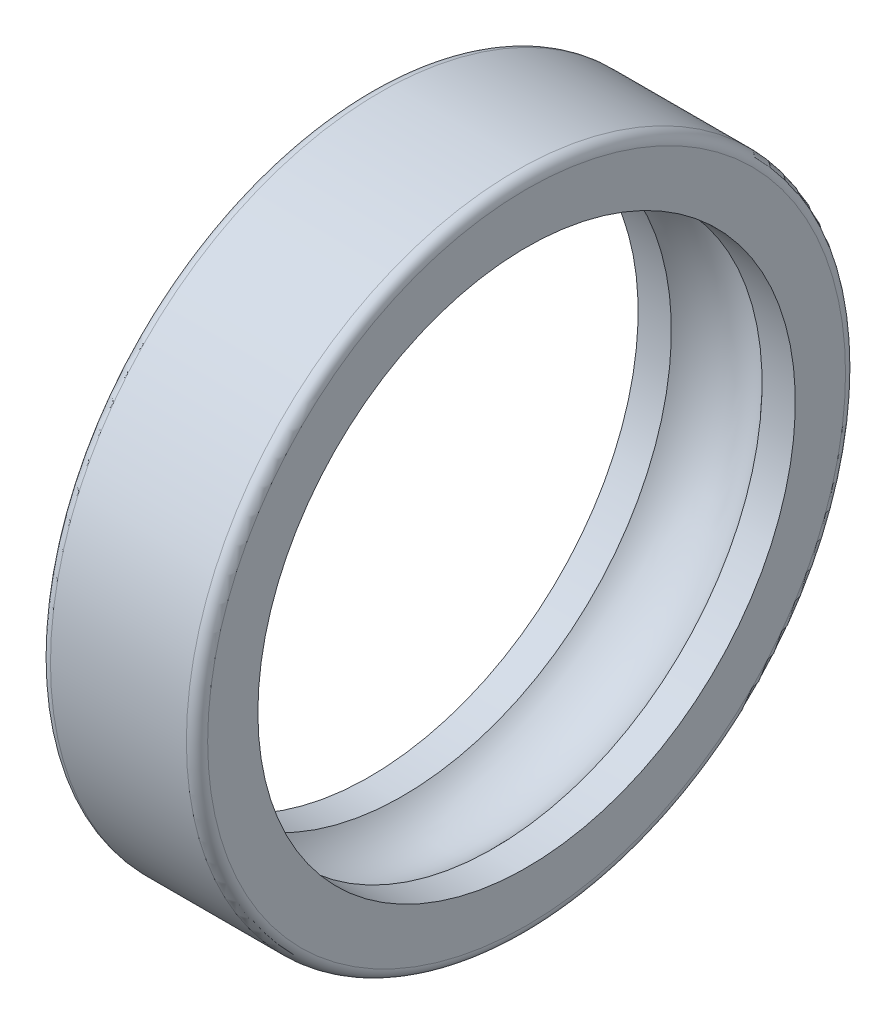
ISO-10303-21;
HEADER;
FILE_DESCRIPTION(('STEP AP214'),'2;1');
FILE_NAME('part.step','',(''),(''),'','','');
FILE_SCHEMA(('AUTOMOTIVE_DESIGN { 1 0 10303 214 1 1 1 1 }'));
ENDSEC;
DATA;
#1=APPLICATION_CONTEXT('core data for automotive mechanical design processes');
#2=APPLICATION_PROTOCOL_DEFINITION('international standard','automotive_design',2000,#1);
#3=PRODUCT_CONTEXT('',#1,'mechanical');
#4=PRODUCT('Part','Part','',(#3));
#5=PRODUCT_RELATED_PRODUCT_CATEGORY('part','',(#4));
#6=PRODUCT_DEFINITION_FORMATION('','',#4);
#7=PRODUCT_DEFINITION_CONTEXT('part definition',#1,'design');
#8=PRODUCT_DEFINITION('design','',#6,#7);
#9=PRODUCT_DEFINITION_SHAPE('','',#8);
#10=(LENGTH_UNIT() NAMED_UNIT(*) SI_UNIT(.MILLI.,.METRE.));
#11=(NAMED_UNIT(*) PLANE_ANGLE_UNIT() SI_UNIT($,.RADIAN.));
#12=(NAMED_UNIT(*) SI_UNIT($,.STERADIAN.) SOLID_ANGLE_UNIT());
#13=UNCERTAINTY_MEASURE_WITH_UNIT(LENGTH_MEASURE(1.E-05),#10,'distance_accuracy_value','');
#14=(GEOMETRIC_REPRESENTATION_CONTEXT(3) GLOBAL_UNCERTAINTY_ASSIGNED_CONTEXT((#13)) GLOBAL_UNIT_ASSIGNED_CONTEXT((#10,
#11,#12)) REPRESENTATION_CONTEXT('',''));
#15=CARTESIAN_POINT('',(0.,0.,0.));
#16=DIRECTION('',(0.,0.,1.));
#17=DIRECTION('',(1.,0.,0.));
#18=AXIS2_PLACEMENT_3D('',#15,#16,#17);
#19=CARTESIAN_POINT('',(-19.1790327753829,0.,0.));
#20=DIRECTION('',(-1.,0.,0.));
#21=DIRECTION('',(0.,0.,1.));
#22=AXIS2_PLACEMENT_3D('',#19,#20,#21);
#23=CYLINDRICAL_SURFACE('',#22,53.);
#24=CARTESIAN_POINT('',(15.5,0.,0.));
#25=DIRECTION('',(-1.,0.,0.));
#26=DIRECTION('',(0.,0.,1.));
#27=AXIS2_PLACEMENT_3D('',#24,#25,#26);
#28=CIRCLE('',#27,53.);
#29=CARTESIAN_POINT('',(15.5,0.,53.));
#30=VERTEX_POINT('',#29);
#31=EDGE_CURVE('E65',#30,#30,#28,.T.);
#32=ORIENTED_EDGE('',*,*,#31,.F.);
#33=EDGE_LOOP('',(#32));
#34=FACE_BOUND('',#33,.T.);
#35=CARTESIAN_POINT('',(8.94427190999916,0.,0.));
#36=DIRECTION('',(-1.,0.,0.));
#37=DIRECTION('',(0.,0.,1.));
#38=AXIS2_PLACEMENT_3D('',#35,#36,#37);
#39=CIRCLE('',#38,53.);
#40=CARTESIAN_POINT('',(8.94427190999916,0.,53.));
#41=VERTEX_POINT('',#40);
#42=EDGE_CURVE('E77',#41,#41,#39,.T.);
#43=ORIENTED_EDGE('',*,*,#42,.T.);
#44=EDGE_LOOP('',(#43));
#45=FACE_BOUND('',#44,.T.);
#46=ADVANCED_FACE('F41',(#34,#45),#23,.F.);
#47=CARTESIAN_POINT('',(15.5,65.,0.));
#48=DIRECTION('',(-1.,0.,0.));
#49=DIRECTION('',(0.,0.,1.));
#50=AXIS2_PLACEMENT_3D('',#47,#48,#49);
#51=PLANE('',#50);
#52=CARTESIAN_POINT('',(15.5,0.,0.));
#53=DIRECTION('',(-1.,0.,0.));
#54=DIRECTION('',(0.,0.,1.));
#55=AXIS2_PLACEMENT_3D('',#52,#53,#54);
#56=CIRCLE('',#55,62.9);
#57=CARTESIAN_POINT('',(15.5,0.,62.9));
#58=VERTEX_POINT('',#57);
#59=EDGE_CURVE('E49',#58,#58,#56,.F.);
#60=ORIENTED_EDGE('',*,*,#59,.T.);
#61=EDGE_LOOP('',(#60));
#62=FACE_BOUND('',#61,.T.);
#63=ORIENTED_EDGE('',*,*,#31,.T.);
#64=EDGE_LOOP('',(#63));
#65=FACE_BOUND('',#64,.T.);
#66=ADVANCED_FACE('F103',(#62,#65),#51,.F.);
#67=CARTESIAN_POINT('',(-19.1790327753829,0.,0.));
#68=DIRECTION('',(-1.,0.,0.));
#69=DIRECTION('',(0.,0.,1.));
#70=AXIS2_PLACEMENT_3D('',#67,#68,#69);
#71=CYLINDRICAL_SURFACE('',#70,65.);
#72=CARTESIAN_POINT('',(13.4,0.,0.));
#73=DIRECTION('',(-1.,0.,0.));
#74=DIRECTION('',(0.,0.,1.));
#75=AXIS2_PLACEMENT_3D('',#72,#73,#74);
#76=CIRCLE('',#75,65.);
#77=CARTESIAN_POINT('',(13.4,0.,65.));
#78=VERTEX_POINT('',#77);
#79=EDGE_CURVE('E54',#78,#78,#76,.T.);
#80=ORIENTED_EDGE('',*,*,#79,.T.);
#81=EDGE_LOOP('',(#80));
#82=FACE_BOUND('',#81,.T.);
#83=CARTESIAN_POINT('',(-13.4,0.,0.));
#84=DIRECTION('',(1.,0.,0.));
#85=DIRECTION('',(0.,0.,-1.));
#86=AXIS2_PLACEMENT_3D('',#83,#84,#85);
#87=CIRCLE('',#86,65.);
#88=CARTESIAN_POINT('',(-13.4,0.,-65.));
#89=VERTEX_POINT('',#88);
#90=EDGE_CURVE('E59',#89,#89,#87,.T.);
#91=ORIENTED_EDGE('',*,*,#90,.T.);
#92=EDGE_LOOP('',(#91));
#93=FACE_BOUND('',#92,.T.);
#94=ADVANCED_FACE('F98',(#82,#93),#71,.T.);
#95=CARTESIAN_POINT('',(-15.5,65.,0.));
#96=DIRECTION('',(1.,0.,0.));
#97=DIRECTION('',(0.,0.,-1.));
#98=AXIS2_PLACEMENT_3D('',#95,#96,#97);
#99=PLANE('',#98);
#100=CARTESIAN_POINT('',(-15.5,0.,0.));
#101=DIRECTION('',(1.,0.,0.));
#102=DIRECTION('',(0.,0.,-1.));
#103=AXIS2_PLACEMENT_3D('',#100,#101,#102);
#104=CIRCLE('',#103,62.9);
#105=CARTESIAN_POINT('',(-15.5,0.,-62.9));
#106=VERTEX_POINT('',#105);
#107=EDGE_CURVE('E10',#106,#106,#104,.F.);
#108=ORIENTED_EDGE('',*,*,#107,.T.);
#109=EDGE_LOOP('',(#108));
#110=FACE_BOUND('',#109,.T.);
#111=CARTESIAN_POINT('',(-15.5,0.,0.));
#112=DIRECTION('',(-1.,0.,0.));
#113=DIRECTION('',(0.,0.,1.));
#114=AXIS2_PLACEMENT_3D('',#111,#112,#113);
#115=CIRCLE('',#114,53.);
#116=CARTESIAN_POINT('',(-15.5,0.,53.));
#117=VERTEX_POINT('',#116);
#118=EDGE_CURVE('E69',#117,#117,#115,.T.);
#119=ORIENTED_EDGE('',*,*,#118,.F.);
#120=EDGE_LOOP('',(#119));
#121=FACE_BOUND('',#120,.T.);
#122=ADVANCED_FACE('F93',(#110,#121),#99,.F.);
#123=CARTESIAN_POINT('',(-19.1790327753829,0.,0.));
#124=DIRECTION('',(-1.,0.,0.));
#125=DIRECTION('',(0.,0.,1.));
#126=AXIS2_PLACEMENT_3D('',#123,#124,#125);
#127=CYLINDRICAL_SURFACE('',#126,53.);
#128=CARTESIAN_POINT('',(-8.94427190999916,0.,0.));
#129=DIRECTION('',(-1.,0.,0.));
#130=DIRECTION('',(0.,0.,1.));
#131=AXIS2_PLACEMENT_3D('',#128,#129,#130);
#132=CIRCLE('',#131,53.);
#133=CARTESIAN_POINT('',(-8.94427190999916,0.,53.));
#134=VERTEX_POINT('',#133);
#135=EDGE_CURVE('E73',#134,#134,#132,.T.);
#136=ORIENTED_EDGE('',*,*,#135,.F.);
#137=EDGE_LOOP('',(#136));
#138=FACE_BOUND('',#137,.T.);
#139=ORIENTED_EDGE('',*,*,#118,.T.);
#140=EDGE_LOOP('',(#139));
#141=FACE_BOUND('',#140,.T.);
#142=ADVANCED_FACE('F87',(#138,#141),#127,.F.);
#143=CARTESIAN_POINT('',(0.,0.,0.));
#144=DIRECTION('',(-1.,0.,0.));
#145=DIRECTION('',(0.,0.,1.));
#146=AXIS2_PLACEMENT_3D('',#143,#144,#145);
#147=TOROIDAL_SURFACE('',#146,45.,12.);
#148=ORIENTED_EDGE('',*,*,#42,.F.);
#149=EDGE_LOOP('',(#148));
#150=FACE_BOUND('',#149,.T.);
#151=ORIENTED_EDGE('',*,*,#135,.T.);
#152=EDGE_LOOP('',(#151));
#153=FACE_BOUND('',#152,.T.);
#154=ADVANCED_FACE('F83',(#150,#153),#147,.F.);
#155=CARTESIAN_POINT('',(13.4,0.,0.));
#156=DIRECTION('',(-1.,0.,0.));
#157=DIRECTION('',(0.,0.,1.));
#158=AXIS2_PLACEMENT_3D('',#155,#156,#157);
#159=TOROIDAL_SURFACE('',#158,62.9,2.1);
#160=ORIENTED_EDGE('',*,*,#59,.F.);
#161=EDGE_LOOP('',(#160));
#162=FACE_BOUND('',#161,.T.);
#163=ORIENTED_EDGE('',*,*,#79,.F.);
#164=EDGE_LOOP('',(#163));
#165=FACE_BOUND('',#164,.T.);
#166=ADVANCED_FACE('F86',(#162,#165),#159,.T.);
#167=CARTESIAN_POINT('',(-13.4,0.,0.));
#168=DIRECTION('',(1.,0.,0.));
#169=DIRECTION('',(0.,0.,-1.));
#170=AXIS2_PLACEMENT_3D('',#167,#168,#169);
#171=TOROIDAL_SURFACE('',#170,62.9,2.1);
#172=ORIENTED_EDGE('',*,*,#90,.F.);
#173=EDGE_LOOP('',(#172));
#174=FACE_BOUND('',#173,.T.);
#175=ORIENTED_EDGE('',*,*,#107,.F.);
#176=EDGE_LOOP('',(#175));
#177=FACE_BOUND('',#176,.T.);
#178=ADVANCED_FACE('F43',(#174,#177),#171,.T.);
#179=CLOSED_SHELL('',(#46,#66,#94,#122,#142,#154,#166,#178));
#180=MANIFOLD_SOLID_BREP('B2',#179);
#181=ADVANCED_BREP_SHAPE_REPRESENTATION('',(#18,#180),#14);
#182=SHAPE_DEFINITION_REPRESENTATION(#9,#181);
ENDSEC;
END-ISO-10303-21;
